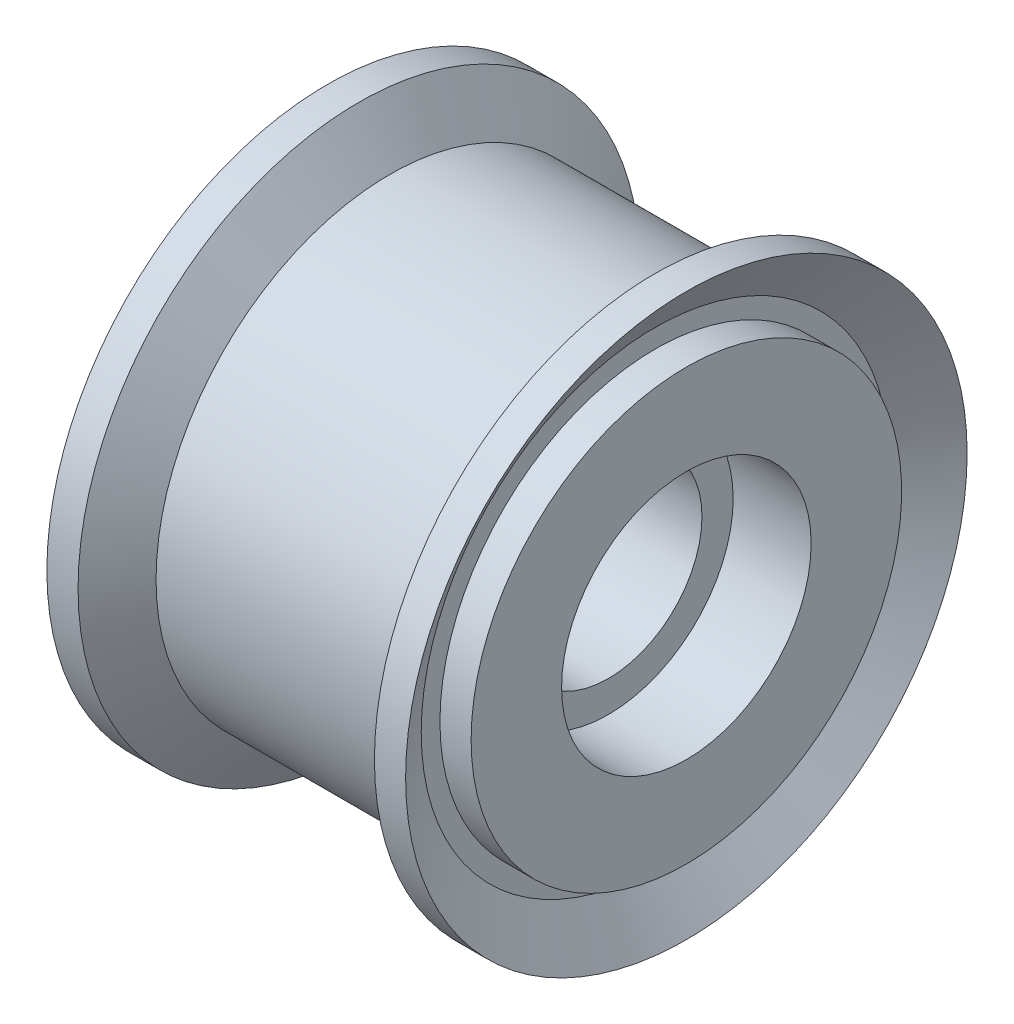
ISO-10303-21;
HEADER;
FILE_DESCRIPTION(('STEP AP214'),'2;1');
FILE_NAME('part.step','',(''),(''),'','','');
FILE_SCHEMA(('AUTOMOTIVE_DESIGN { 1 0 10303 214 1 1 1 1 }'));
ENDSEC;
DATA;
#1=APPLICATION_CONTEXT('core data for automotive mechanical design processes');
#2=APPLICATION_PROTOCOL_DEFINITION('international standard','automotive_design',2000,#1);
#3=PRODUCT_CONTEXT('',#1,'mechanical');
#4=PRODUCT('Part','Part','',(#3));
#5=PRODUCT_RELATED_PRODUCT_CATEGORY('part','',(#4));
#6=PRODUCT_DEFINITION_FORMATION('','',#4);
#7=PRODUCT_DEFINITION_CONTEXT('part definition',#1,'design');
#8=PRODUCT_DEFINITION('design','',#6,#7);
#9=PRODUCT_DEFINITION_SHAPE('','',#8);
#10=(LENGTH_UNIT() NAMED_UNIT(*) SI_UNIT(.MILLI.,.METRE.));
#11=(NAMED_UNIT(*) PLANE_ANGLE_UNIT() SI_UNIT($,.RADIAN.));
#12=(NAMED_UNIT(*) SI_UNIT($,.STERADIAN.) SOLID_ANGLE_UNIT());
#13=UNCERTAINTY_MEASURE_WITH_UNIT(LENGTH_MEASURE(1.E-05),#10,'distance_accuracy_value','');
#14=(GEOMETRIC_REPRESENTATION_CONTEXT(3) GLOBAL_UNCERTAINTY_ASSIGNED_CONTEXT((#13)) GLOBAL_UNIT_ASSIGNED_CONTEXT((#10,
#11,#12)) REPRESENTATION_CONTEXT('',''));
#15=CARTESIAN_POINT('',(0.,0.,0.));
#16=DIRECTION('',(0.,0.,1.));
#17=DIRECTION('',(1.,0.,0.));
#18=AXIS2_PLACEMENT_3D('',#15,#16,#17);
#19=CARTESIAN_POINT('',(5.75,0.,0.));
#20=DIRECTION('',(-1.,0.,0.));
#21=DIRECTION('',(0.,0.,1.));
#22=AXIS2_PLACEMENT_3D('',#19,#20,#21);
#23=CYLINDRICAL_SURFACE('',#22,9.);
#24=CARTESIAN_POINT('',(-5.75,0.,0.));
#25=DIRECTION('',(-1.,0.,0.));
#26=DIRECTION('',(0.,0.,1.));
#27=AXIS2_PLACEMENT_3D('',#24,#25,#26);
#28=CIRCLE('',#27,9.);
#29=CARTESIAN_POINT('',(-5.75,0.,9.));
#30=VERTEX_POINT('',#29);
#31=EDGE_CURVE('E10',#30,#30,#28,.T.);
#32=ORIENTED_EDGE('',*,*,#31,.F.);
#33=EDGE_LOOP('',(#32));
#34=FACE_BOUND('',#33,.T.);
#35=CARTESIAN_POINT('',(-4.75,0.,0.));
#36=DIRECTION('',(-1.,0.,0.));
#37=DIRECTION('',(0.,0.,1.));
#38=AXIS2_PLACEMENT_3D('',#35,#36,#37);
#39=CIRCLE('',#38,9.);
#40=CARTESIAN_POINT('',(-4.75,0.,9.));
#41=VERTEX_POINT('',#40);
#42=EDGE_CURVE('E87',#41,#41,#39,.T.);
#43=ORIENTED_EDGE('',*,*,#42,.T.);
#44=EDGE_LOOP('',(#43));
#45=FACE_BOUND('',#44,.T.);
#46=ADVANCED_FACE('F29',(#34,#45),#23,.T.);
#47=CARTESIAN_POINT('',(-5.75,0.,0.));
#48=DIRECTION('',(-1.,0.,0.));
#49=DIRECTION('',(0.,0.,1.));
#50=AXIS2_PLACEMENT_3D('',#47,#48,#49);
#51=CONICAL_SURFACE('',#50,9.,0.982793723247328);
#52=CARTESIAN_POINT('',(-4.75,0.,0.));
#53=DIRECTION('',(-1.,0.,0.));
#54=DIRECTION('',(0.,0.,1.));
#55=AXIS2_PLACEMENT_3D('',#52,#53,#54);
#56=CIRCLE('',#55,7.5);
#57=CARTESIAN_POINT('',(-4.75,0.,7.5));
#58=VERTEX_POINT('',#57);
#59=EDGE_CURVE('E35',#58,#58,#56,.T.);
#60=ORIENTED_EDGE('',*,*,#59,.F.);
#61=EDGE_LOOP('',(#60));
#62=FACE_BOUND('',#61,.T.);
#63=ORIENTED_EDGE('',*,*,#31,.T.);
#64=EDGE_LOOP('',(#63));
#65=FACE_BOUND('',#64,.T.);
#66=ADVANCED_FACE('F184',(#62,#65),#51,.F.);
#67=CARTESIAN_POINT('',(-4.75,7.5,0.));
#68=DIRECTION('',(1.,0.,0.));
#69=DIRECTION('',(0.,0.,-1.));
#70=AXIS2_PLACEMENT_3D('',#67,#68,#69);
#71=PLANE('',#70);
#72=CARTESIAN_POINT('',(-4.75,0.,0.));
#73=DIRECTION('',(-1.,0.,0.));
#74=DIRECTION('',(0.,0.,1.));
#75=AXIS2_PLACEMENT_3D('',#72,#73,#74);
#76=CIRCLE('',#75,6.9);
#77=CARTESIAN_POINT('',(-4.75,0.,6.9));
#78=VERTEX_POINT('',#77);
#79=EDGE_CURVE('E39',#78,#78,#76,.T.);
#80=ORIENTED_EDGE('',*,*,#79,.F.);
#81=EDGE_LOOP('',(#80));
#82=FACE_BOUND('',#81,.T.);
#83=ORIENTED_EDGE('',*,*,#59,.T.);
#84=EDGE_LOOP('',(#83));
#85=FACE_BOUND('',#84,.T.);
#86=ADVANCED_FACE('F179',(#82,#85),#71,.F.);
#87=CARTESIAN_POINT('',(5.75,0.,0.));
#88=DIRECTION('',(-1.,0.,0.));
#89=DIRECTION('',(0.,0.,1.));
#90=AXIS2_PLACEMENT_3D('',#87,#88,#89);
#91=CYLINDRICAL_SURFACE('',#90,6.9);
#92=CARTESIAN_POINT('',(-5.75,0.,0.));
#93=DIRECTION('',(-1.,0.,0.));
#94=DIRECTION('',(0.,0.,1.));
#95=AXIS2_PLACEMENT_3D('',#92,#93,#94);
#96=CIRCLE('',#95,6.9);
#97=CARTESIAN_POINT('',(-5.75,0.,6.9));
#98=VERTEX_POINT('',#97);
#99=EDGE_CURVE('E43',#98,#98,#96,.T.);
#100=ORIENTED_EDGE('',*,*,#99,.F.);
#101=EDGE_LOOP('',(#100));
#102=FACE_BOUND('',#101,.T.);
#103=ORIENTED_EDGE('',*,*,#79,.T.);
#104=EDGE_LOOP('',(#103));
#105=FACE_BOUND('',#104,.T.);
#106=ADVANCED_FACE('F173',(#102,#105),#91,.T.);
#107=CARTESIAN_POINT('',(-5.75,6.9,0.));
#108=DIRECTION('',(1.,0.,0.));
#109=DIRECTION('',(0.,0.,-1.));
#110=AXIS2_PLACEMENT_3D('',#107,#108,#109);
#111=PLANE('',#110);
#112=CARTESIAN_POINT('',(-5.75,0.,0.));
#113=DIRECTION('',(-1.,0.,0.));
#114=DIRECTION('',(0.,0.,1.));
#115=AXIS2_PLACEMENT_3D('',#112,#113,#114);
#116=CIRCLE('',#115,4.);
#117=CARTESIAN_POINT('',(-5.75,0.,4.));
#118=VERTEX_POINT('',#117);
#119=EDGE_CURVE('E48',#118,#118,#116,.T.);
#120=ORIENTED_EDGE('',*,*,#119,.F.);
#121=EDGE_LOOP('',(#120));
#122=FACE_BOUND('',#121,.T.);
#123=ORIENTED_EDGE('',*,*,#99,.T.);
#124=EDGE_LOOP('',(#123));
#125=FACE_BOUND('',#124,.T.);
#126=ADVANCED_FACE('F167',(#122,#125),#111,.F.);
#127=CARTESIAN_POINT('',(5.75,0.,0.));
#128=DIRECTION('',(-1.,0.,0.));
#129=DIRECTION('',(0.,0.,1.));
#130=AXIS2_PLACEMENT_3D('',#127,#128,#129);
#131=CYLINDRICAL_SURFACE('',#130,4.);
#132=CARTESIAN_POINT('',(-3.25,0.,0.));
#133=DIRECTION('',(-1.,0.,0.));
#134=DIRECTION('',(0.,0.,1.));
#135=AXIS2_PLACEMENT_3D('',#132,#133,#134);
#136=CIRCLE('',#135,4.);
#137=CARTESIAN_POINT('',(-3.25,0.,4.));
#138=VERTEX_POINT('',#137);
#139=EDGE_CURVE('E51',#138,#138,#136,.T.);
#140=ORIENTED_EDGE('',*,*,#139,.F.);
#141=EDGE_LOOP('',(#140));
#142=FACE_BOUND('',#141,.T.);
#143=ORIENTED_EDGE('',*,*,#119,.T.);
#144=EDGE_LOOP('',(#143));
#145=FACE_BOUND('',#144,.T.);
#146=ADVANCED_FACE('F161',(#142,#145),#131,.F.);
#147=CARTESIAN_POINT('',(-3.25,4.,0.));
#148=DIRECTION('',(1.,0.,0.));
#149=DIRECTION('',(0.,0.,-1.));
#150=AXIS2_PLACEMENT_3D('',#147,#148,#149);
#151=PLANE('',#150);
#152=CARTESIAN_POINT('',(-3.25,0.,0.));
#153=DIRECTION('',(-1.,0.,0.));
#154=DIRECTION('',(0.,0.,1.));
#155=AXIS2_PLACEMENT_3D('',#152,#153,#154);
#156=CIRCLE('',#155,3.);
#157=CARTESIAN_POINT('',(-3.25,0.,3.));
#158=VERTEX_POINT('',#157);
#159=EDGE_CURVE('E54',#158,#158,#156,.T.);
#160=ORIENTED_EDGE('',*,*,#159,.F.);
#161=EDGE_LOOP('',(#160));
#162=FACE_BOUND('',#161,.T.);
#163=ORIENTED_EDGE('',*,*,#139,.T.);
#164=EDGE_LOOP('',(#163));
#165=FACE_BOUND('',#164,.T.);
#166=ADVANCED_FACE('F155',(#162,#165),#151,.F.);
#167=CARTESIAN_POINT('',(5.75,0.,0.));
#168=DIRECTION('',(-1.,0.,0.));
#169=DIRECTION('',(0.,0.,1.));
#170=AXIS2_PLACEMENT_3D('',#167,#168,#169);
#171=CYLINDRICAL_SURFACE('',#170,3.);
#172=CARTESIAN_POINT('',(3.25,0.,0.));
#173=DIRECTION('',(-1.,0.,0.));
#174=DIRECTION('',(0.,0.,1.));
#175=AXIS2_PLACEMENT_3D('',#172,#173,#174);
#176=CIRCLE('',#175,3.);
#177=CARTESIAN_POINT('',(3.25,0.,3.));
#178=VERTEX_POINT('',#177);
#179=EDGE_CURVE('E57',#178,#178,#176,.T.);
#180=ORIENTED_EDGE('',*,*,#179,.F.);
#181=EDGE_LOOP('',(#180));
#182=FACE_BOUND('',#181,.T.);
#183=ORIENTED_EDGE('',*,*,#159,.T.);
#184=EDGE_LOOP('',(#183));
#185=FACE_BOUND('',#184,.T.);
#186=ADVANCED_FACE('F149',(#182,#185),#171,.F.);
#187=CARTESIAN_POINT('',(3.25,3.,0.));
#188=DIRECTION('',(-1.,0.,0.));
#189=DIRECTION('',(0.,0.,1.));
#190=AXIS2_PLACEMENT_3D('',#187,#188,#189);
#191=PLANE('',#190);
#192=CARTESIAN_POINT('',(3.25,0.,0.));
#193=DIRECTION('',(-1.,0.,0.));
#194=DIRECTION('',(0.,0.,1.));
#195=AXIS2_PLACEMENT_3D('',#192,#193,#194);
#196=CIRCLE('',#195,4.);
#197=CARTESIAN_POINT('',(3.25,0.,4.));
#198=VERTEX_POINT('',#197);
#199=EDGE_CURVE('E60',#198,#198,#196,.T.);
#200=ORIENTED_EDGE('',*,*,#199,.F.);
#201=EDGE_LOOP('',(#200));
#202=FACE_BOUND('',#201,.T.);
#203=ORIENTED_EDGE('',*,*,#179,.T.);
#204=EDGE_LOOP('',(#203));
#205=FACE_BOUND('',#204,.T.);
#206=ADVANCED_FACE('F143',(#202,#205),#191,.F.);
#207=CARTESIAN_POINT('',(5.75,0.,0.));
#208=DIRECTION('',(-1.,0.,0.));
#209=DIRECTION('',(0.,0.,1.));
#210=AXIS2_PLACEMENT_3D('',#207,#208,#209);
#211=CYLINDRICAL_SURFACE('',#210,4.);
#212=CARTESIAN_POINT('',(5.75,0.,0.));
#213=DIRECTION('',(-1.,0.,0.));
#214=DIRECTION('',(0.,0.,1.));
#215=AXIS2_PLACEMENT_3D('',#212,#213,#214);
#216=CIRCLE('',#215,4.);
#217=CARTESIAN_POINT('',(5.75,0.,4.));
#218=VERTEX_POINT('',#217);
#219=EDGE_CURVE('E63',#218,#218,#216,.T.);
#220=ORIENTED_EDGE('',*,*,#219,.F.);
#221=EDGE_LOOP('',(#220));
#222=FACE_BOUND('',#221,.T.);
#223=ORIENTED_EDGE('',*,*,#199,.T.);
#224=EDGE_LOOP('',(#223));
#225=FACE_BOUND('',#224,.T.);
#226=ADVANCED_FACE('F137',(#222,#225),#211,.F.);
#227=CARTESIAN_POINT('',(5.75,4.,0.));
#228=DIRECTION('',(-1.,0.,0.));
#229=DIRECTION('',(0.,0.,1.));
#230=AXIS2_PLACEMENT_3D('',#227,#228,#229);
#231=PLANE('',#230);
#232=CARTESIAN_POINT('',(5.75,0.,0.));
#233=DIRECTION('',(-1.,0.,0.));
#234=DIRECTION('',(0.,0.,1.));
#235=AXIS2_PLACEMENT_3D('',#232,#233,#234);
#236=CIRCLE('',#235,6.9);
#237=CARTESIAN_POINT('',(5.75,0.,6.9));
#238=VERTEX_POINT('',#237);
#239=EDGE_CURVE('E66',#238,#238,#236,.T.);
#240=ORIENTED_EDGE('',*,*,#239,.F.);
#241=EDGE_LOOP('',(#240));
#242=FACE_BOUND('',#241,.T.);
#243=ORIENTED_EDGE('',*,*,#219,.T.);
#244=EDGE_LOOP('',(#243));
#245=FACE_BOUND('',#244,.T.);
#246=ADVANCED_FACE('F131',(#242,#245),#231,.F.);
#247=CARTESIAN_POINT('',(5.75,0.,0.));
#248=DIRECTION('',(-1.,0.,0.));
#249=DIRECTION('',(0.,0.,1.));
#250=AXIS2_PLACEMENT_3D('',#247,#248,#249);
#251=CYLINDRICAL_SURFACE('',#250,6.9);
#252=CARTESIAN_POINT('',(4.75,0.,0.));
#253=DIRECTION('',(-1.,0.,0.));
#254=DIRECTION('',(0.,0.,1.));
#255=AXIS2_PLACEMENT_3D('',#252,#253,#254);
#256=CIRCLE('',#255,6.9);
#257=CARTESIAN_POINT('',(4.75,0.,6.9));
#258=VERTEX_POINT('',#257);
#259=EDGE_CURVE('E69',#258,#258,#256,.T.);
#260=ORIENTED_EDGE('',*,*,#259,.F.);
#261=EDGE_LOOP('',(#260));
#262=FACE_BOUND('',#261,.T.);
#263=ORIENTED_EDGE('',*,*,#239,.T.);
#264=EDGE_LOOP('',(#263));
#265=FACE_BOUND('',#264,.T.);
#266=ADVANCED_FACE('F125',(#262,#265),#251,.T.);
#267=CARTESIAN_POINT('',(4.75,6.9,0.));
#268=DIRECTION('',(-1.,0.,0.));
#269=DIRECTION('',(0.,0.,1.));
#270=AXIS2_PLACEMENT_3D('',#267,#268,#269);
#271=PLANE('',#270);
#272=CARTESIAN_POINT('',(4.75,0.,0.));
#273=DIRECTION('',(-1.,0.,0.));
#274=DIRECTION('',(0.,0.,1.));
#275=AXIS2_PLACEMENT_3D('',#272,#273,#274);
#276=CIRCLE('',#275,7.5);
#277=CARTESIAN_POINT('',(4.75,0.,7.5));
#278=VERTEX_POINT('',#277);
#279=EDGE_CURVE('E72',#278,#278,#276,.T.);
#280=ORIENTED_EDGE('',*,*,#279,.F.);
#281=EDGE_LOOP('',(#280));
#282=FACE_BOUND('',#281,.T.);
#283=ORIENTED_EDGE('',*,*,#259,.T.);
#284=EDGE_LOOP('',(#283));
#285=FACE_BOUND('',#284,.T.);
#286=ADVANCED_FACE('F119',(#282,#285),#271,.F.);
#287=CARTESIAN_POINT('',(4.75,0.,0.));
#288=DIRECTION('',(1.,0.,0.));
#289=DIRECTION('',(0.,0.,-1.));
#290=AXIS2_PLACEMENT_3D('',#287,#288,#289);
#291=CONICAL_SURFACE('',#290,7.5,0.982793723247329);
#292=CARTESIAN_POINT('',(5.75,0.,0.));
#293=DIRECTION('',(-1.,0.,0.));
#294=DIRECTION('',(0.,0.,1.));
#295=AXIS2_PLACEMENT_3D('',#292,#293,#294);
#296=CIRCLE('',#295,9.);
#297=CARTESIAN_POINT('',(5.75,0.,9.));
#298=VERTEX_POINT('',#297);
#299=EDGE_CURVE('E75',#298,#298,#296,.T.);
#300=ORIENTED_EDGE('',*,*,#299,.F.);
#301=EDGE_LOOP('',(#300));
#302=FACE_BOUND('',#301,.T.);
#303=ORIENTED_EDGE('',*,*,#279,.T.);
#304=EDGE_LOOP('',(#303));
#305=FACE_BOUND('',#304,.T.);
#306=ADVANCED_FACE('F113',(#302,#305),#291,.F.);
#307=CARTESIAN_POINT('',(5.75,0.,0.));
#308=DIRECTION('',(-1.,0.,0.));
#309=DIRECTION('',(0.,0.,1.));
#310=AXIS2_PLACEMENT_3D('',#307,#308,#309);
#311=CYLINDRICAL_SURFACE('',#310,9.);
#312=CARTESIAN_POINT('',(4.75,0.,0.));
#313=DIRECTION('',(-1.,0.,0.));
#314=DIRECTION('',(0.,0.,1.));
#315=AXIS2_PLACEMENT_3D('',#312,#313,#314);
#316=CIRCLE('',#315,9.);
#317=CARTESIAN_POINT('',(4.75,0.,9.));
#318=VERTEX_POINT('',#317);
#319=EDGE_CURVE('E78',#318,#318,#316,.T.);
#320=ORIENTED_EDGE('',*,*,#319,.F.);
#321=EDGE_LOOP('',(#320));
#322=FACE_BOUND('',#321,.T.);
#323=ORIENTED_EDGE('',*,*,#299,.T.);
#324=EDGE_LOOP('',(#323));
#325=FACE_BOUND('',#324,.T.);
#326=ADVANCED_FACE('F107',(#322,#325),#311,.T.);
#327=CARTESIAN_POINT('',(4.75,0.,0.));
#328=DIRECTION('',(1.,0.,0.));
#329=DIRECTION('',(0.,0.,-1.));
#330=AXIS2_PLACEMENT_3D('',#327,#328,#329);
#331=CONICAL_SURFACE('',#330,9.,0.982793723247329);
#332=CARTESIAN_POINT('',(3.75,0.,0.));
#333=DIRECTION('',(-1.,0.,0.));
#334=DIRECTION('',(0.,0.,1.));
#335=AXIS2_PLACEMENT_3D('',#332,#333,#334);
#336=CIRCLE('',#335,7.5);
#337=CARTESIAN_POINT('',(3.75,0.,7.5));
#338=VERTEX_POINT('',#337);
#339=EDGE_CURVE('E81',#338,#338,#336,.T.);
#340=ORIENTED_EDGE('',*,*,#339,.F.);
#341=EDGE_LOOP('',(#340));
#342=FACE_BOUND('',#341,.T.);
#343=ORIENTED_EDGE('',*,*,#319,.T.);
#344=EDGE_LOOP('',(#343));
#345=FACE_BOUND('',#344,.T.);
#346=ADVANCED_FACE('F101',(#342,#345),#331,.T.);
#347=CARTESIAN_POINT('',(5.75,0.,0.));
#348=DIRECTION('',(-1.,0.,0.));
#349=DIRECTION('',(0.,0.,1.));
#350=AXIS2_PLACEMENT_3D('',#347,#348,#349);
#351=CYLINDRICAL_SURFACE('',#350,7.5);
#352=CARTESIAN_POINT('',(-3.75,0.,0.));
#353=DIRECTION('',(-1.,0.,0.));
#354=DIRECTION('',(0.,0.,1.));
#355=AXIS2_PLACEMENT_3D('',#352,#353,#354);
#356=CIRCLE('',#355,7.5);
#357=CARTESIAN_POINT('',(-3.75,0.,7.5));
#358=VERTEX_POINT('',#357);
#359=EDGE_CURVE('E84',#358,#358,#356,.T.);
#360=ORIENTED_EDGE('',*,*,#359,.F.);
#361=EDGE_LOOP('',(#360));
#362=FACE_BOUND('',#361,.T.);
#363=ORIENTED_EDGE('',*,*,#339,.T.);
#364=EDGE_LOOP('',(#363));
#365=FACE_BOUND('',#364,.T.);
#366=ADVANCED_FACE('F95',(#362,#365),#351,.T.);
#367=CARTESIAN_POINT('',(-3.75,0.,0.));
#368=DIRECTION('',(-1.,0.,0.));
#369=DIRECTION('',(0.,0.,1.));
#370=AXIS2_PLACEMENT_3D('',#367,#368,#369);
#371=CONICAL_SURFACE('',#370,7.5,0.982793723247329);
#372=ORIENTED_EDGE('',*,*,#42,.F.);
#373=EDGE_LOOP('',(#372));
#374=FACE_BOUND('',#373,.T.);
#375=ORIENTED_EDGE('',*,*,#359,.T.);
#376=EDGE_LOOP('',(#375));
#377=FACE_BOUND('',#376,.T.);
#378=ADVANCED_FACE('F92',(#374,#377),#371,.T.);
#379=CLOSED_SHELL('',(#46,#66,#86,#106,#126,#146,#166,#186,#206,#226,#246,#266,#286,#306,#326,
#346,#366,#378));
#380=MANIFOLD_SOLID_BREP('B2',#379);
#381=ADVANCED_BREP_SHAPE_REPRESENTATION('',(#18,#380),#14);
#382=SHAPE_DEFINITION_REPRESENTATION(#9,#381);
ENDSEC;
END-ISO-10303-21;
